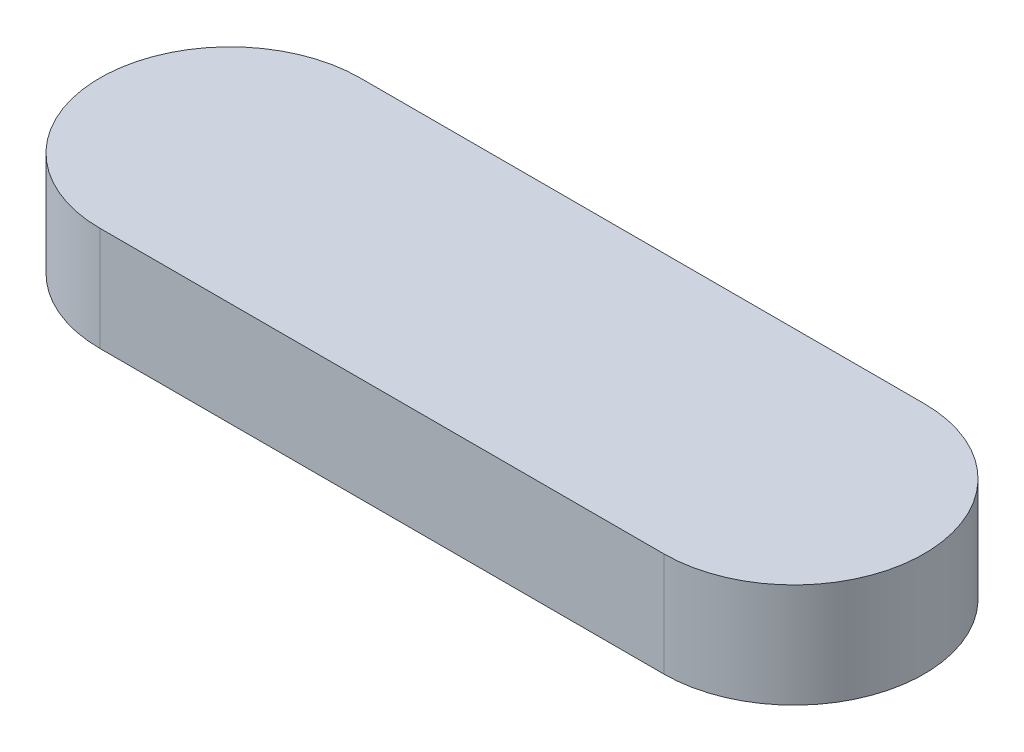
ISO-10303-21;
HEADER;
FILE_DESCRIPTION(('STEP AP214'),'2;1');
FILE_NAME('part.step','',(''),(''),'','','');
FILE_SCHEMA(('AUTOMOTIVE_DESIGN { 1 0 10303 214 1 1 1 1 }'));
ENDSEC;
DATA;
#1=APPLICATION_CONTEXT('core data for automotive mechanical design processes');
#2=APPLICATION_PROTOCOL_DEFINITION('international standard','automotive_design',2000,#1);
#3=PRODUCT_CONTEXT('',#1,'mechanical');
#4=PRODUCT('Part','Part','',(#3));
#5=PRODUCT_RELATED_PRODUCT_CATEGORY('part','',(#4));
#6=PRODUCT_DEFINITION_FORMATION('','',#4);
#7=PRODUCT_DEFINITION_CONTEXT('part definition',#1,'design');
#8=PRODUCT_DEFINITION('design','',#6,#7);
#9=PRODUCT_DEFINITION_SHAPE('','',#8);
#10=(LENGTH_UNIT() NAMED_UNIT(*) SI_UNIT(.MILLI.,.METRE.));
#11=(NAMED_UNIT(*) PLANE_ANGLE_UNIT() SI_UNIT($,.RADIAN.));
#12=(NAMED_UNIT(*) SI_UNIT($,.STERADIAN.) SOLID_ANGLE_UNIT());
#13=UNCERTAINTY_MEASURE_WITH_UNIT(LENGTH_MEASURE(1.E-05),#10,'distance_accuracy_value','');
#14=(GEOMETRIC_REPRESENTATION_CONTEXT(3) GLOBAL_UNCERTAINTY_ASSIGNED_CONTEXT((#13)) GLOBAL_UNIT_ASSIGNED_CONTEXT((#10,
#11,#12)) REPRESENTATION_CONTEXT('',''));
#15=CARTESIAN_POINT('',(0.,0.,0.));
#16=DIRECTION('',(0.,0.,1.));
#17=DIRECTION('',(1.,0.,0.));
#18=AXIS2_PLACEMENT_3D('',#15,#16,#17);
#19=CARTESIAN_POINT('',(-32.5,12.,-15.));
#20=DIRECTION('',(0.,0.,-1.));
#21=DIRECTION('',(-1.,0.,0.));
#22=AXIS2_PLACEMENT_3D('',#19,#20,#21);
#23=PLANE('',#22);
#24=DIRECTION('',(1.,0.,0.));
#25=VECTOR('',#24,1.);
#26=CARTESIAN_POINT('',(-32.5,0.,-15.));
#27=LINE('',#26,#25);
#28=CARTESIAN_POINT('',(-32.5,0.,-15.));
#29=VERTEX_POINT('',#28);
#30=CARTESIAN_POINT('',(32.5,0.,-15.));
#31=VERTEX_POINT('',#30);
#32=EDGE_CURVE('E106',#29,#31,#27,.T.);
#33=ORIENTED_EDGE('',*,*,#32,.F.);
#34=DIRECTION('',(0.,-1.,0.));
#35=VECTOR('',#34,1.);
#36=CARTESIAN_POINT('',(-32.5,12.,-15.));
#37=LINE('',#36,#35);
#38=CARTESIAN_POINT('',(-32.5,12.,-15.));
#39=VERTEX_POINT('',#38);
#40=EDGE_CURVE('E11',#39,#29,#37,.T.);
#41=ORIENTED_EDGE('',*,*,#40,.F.);
#42=DIRECTION('',(1.,0.,0.));
#43=VECTOR('',#42,1.);
#44=CARTESIAN_POINT('',(-32.5,12.,-15.));
#45=LINE('',#44,#43);
#46=CARTESIAN_POINT('',(32.5,12.,-15.));
#47=VERTEX_POINT('',#46);
#48=EDGE_CURVE('E101',#39,#47,#45,.T.);
#49=ORIENTED_EDGE('',*,*,#48,.T.);
#50=DIRECTION('',(0.,-1.,0.));
#51=VECTOR('',#50,1.);
#52=CARTESIAN_POINT('',(32.5,12.,-15.));
#53=LINE('',#52,#51);
#54=EDGE_CURVE('E44',#47,#31,#53,.T.);
#55=ORIENTED_EDGE('',*,*,#54,.T.);
#56=EDGE_LOOP('',(#33,#41,#49,#55));
#57=FACE_BOUND('',#56,.T.);
#58=ADVANCED_FACE('F41',(#57),#23,.T.);
#59=CARTESIAN_POINT('',(-32.5,12.,0.));
#60=DIRECTION('',(0.,-1.,0.));
#61=DIRECTION('',(0.,0.,-1.));
#62=AXIS2_PLACEMENT_3D('',#59,#60,#61);
#63=CYLINDRICAL_SURFACE('',#62,15.);
#64=CARTESIAN_POINT('',(-32.5,0.,0.));
#65=DIRECTION('',(0.,1.,0.));
#66=DIRECTION('',(0.,0.,1.));
#67=AXIS2_PLACEMENT_3D('',#64,#65,#66);
#68=CIRCLE('',#67,15.);
#69=CARTESIAN_POINT('',(-32.5,0.,15.));
#70=VERTEX_POINT('',#69);
#71=EDGE_CURVE('E74',#29,#70,#68,.T.);
#72=ORIENTED_EDGE('',*,*,#71,.T.);
#73=DIRECTION('',(0.,-1.,0.));
#74=VECTOR('',#73,1.);
#75=CARTESIAN_POINT('',(-32.5,12.,15.));
#76=LINE('',#75,#74);
#77=CARTESIAN_POINT('',(-32.5,12.,15.));
#78=VERTEX_POINT('',#77);
#79=EDGE_CURVE('E50',#78,#70,#76,.T.);
#80=ORIENTED_EDGE('',*,*,#79,.F.);
#81=CARTESIAN_POINT('',(-32.5,12.,0.));
#82=DIRECTION('',(0.,1.,0.));
#83=DIRECTION('',(0.,0.,1.));
#84=AXIS2_PLACEMENT_3D('',#81,#82,#83);
#85=CIRCLE('',#84,15.);
#86=EDGE_CURVE('E89',#39,#78,#85,.T.);
#87=ORIENTED_EDGE('',*,*,#86,.F.);
#88=ORIENTED_EDGE('',*,*,#40,.T.);
#89=EDGE_LOOP('',(#72,#80,#87,#88));
#90=FACE_BOUND('',#89,.T.);
#91=ADVANCED_FACE('F116',(#90),#63,.T.);
#92=CARTESIAN_POINT('',(-32.5,12.,15.));
#93=DIRECTION('',(0.,0.,-1.));
#94=DIRECTION('',(-1.,0.,0.));
#95=AXIS2_PLACEMENT_3D('',#92,#93,#94);
#96=PLANE('',#95);
#97=DIRECTION('',(1.,0.,0.));
#98=VECTOR('',#97,1.);
#99=CARTESIAN_POINT('',(-32.5,0.,15.));
#100=LINE('',#99,#98);
#101=CARTESIAN_POINT('',(32.5,0.,15.));
#102=VERTEX_POINT('',#101);
#103=EDGE_CURVE('E96',#70,#102,#100,.T.);
#104=ORIENTED_EDGE('',*,*,#103,.T.);
#105=DIRECTION('',(0.,-1.,0.));
#106=VECTOR('',#105,1.);
#107=CARTESIAN_POINT('',(32.5,12.,15.));
#108=LINE('',#107,#106);
#109=CARTESIAN_POINT('',(32.5,12.,15.));
#110=VERTEX_POINT('',#109);
#111=EDGE_CURVE('E93',#110,#102,#108,.T.);
#112=ORIENTED_EDGE('',*,*,#111,.F.);
#113=DIRECTION('',(1.,0.,0.));
#114=VECTOR('',#113,1.);
#115=CARTESIAN_POINT('',(-32.5,12.,15.));
#116=LINE('',#115,#114);
#117=EDGE_CURVE('E86',#78,#110,#116,.T.);
#118=ORIENTED_EDGE('',*,*,#117,.F.);
#119=ORIENTED_EDGE('',*,*,#79,.T.);
#120=EDGE_LOOP('',(#104,#112,#118,#119));
#121=FACE_BOUND('',#120,.T.);
#122=ADVANCED_FACE('F94',(#121),#96,.F.);
#123=CARTESIAN_POINT('',(32.5,12.,0.));
#124=DIRECTION('',(0.,-1.,0.));
#125=DIRECTION('',(0.,0.,-1.));
#126=AXIS2_PLACEMENT_3D('',#123,#124,#125);
#127=CYLINDRICAL_SURFACE('',#126,15.);
#128=CARTESIAN_POINT('',(32.5,0.,0.));
#129=DIRECTION('',(0.,1.,0.));
#130=DIRECTION('',(0.,0.,1.));
#131=AXIS2_PLACEMENT_3D('',#128,#129,#130);
#132=CIRCLE('',#131,15.);
#133=EDGE_CURVE('E109',#102,#31,#132,.T.);
#134=ORIENTED_EDGE('',*,*,#133,.T.);
#135=ORIENTED_EDGE('',*,*,#54,.F.);
#136=CARTESIAN_POINT('',(32.5,12.,0.));
#137=DIRECTION('',(0.,1.,0.));
#138=DIRECTION('',(0.,0.,1.));
#139=AXIS2_PLACEMENT_3D('',#136,#137,#138);
#140=CIRCLE('',#139,15.);
#141=EDGE_CURVE('E83',#110,#47,#140,.T.);
#142=ORIENTED_EDGE('',*,*,#141,.F.);
#143=ORIENTED_EDGE('',*,*,#111,.T.);
#144=EDGE_LOOP('',(#134,#135,#142,#143));
#145=FACE_BOUND('',#144,.T.);
#146=ADVANCED_FACE('F100',(#145),#127,.T.);
#147=CARTESIAN_POINT('',(32.5,12.,0.));
#148=DIRECTION('',(0.,1.,0.));
#149=DIRECTION('',(0.,0.,1.));
#150=AXIS2_PLACEMENT_3D('',#147,#148,#149);
#151=PLANE('',#150);
#152=ORIENTED_EDGE('',*,*,#48,.F.);
#153=ORIENTED_EDGE('',*,*,#86,.T.);
#154=ORIENTED_EDGE('',*,*,#117,.T.);
#155=ORIENTED_EDGE('',*,*,#141,.T.);
#156=EDGE_LOOP('',(#152,#153,#154,#155));
#157=FACE_BOUND('',#156,.T.);
#158=ADVANCED_FACE('F88',(#157),#151,.T.);
#159=CARTESIAN_POINT('',(32.5,0.,0.));
#160=DIRECTION('',(0.,1.,0.));
#161=DIRECTION('',(0.,0.,1.));
#162=AXIS2_PLACEMENT_3D('',#159,#160,#161);
#163=PLANE('',#162);
#164=ORIENTED_EDGE('',*,*,#32,.T.);
#165=ORIENTED_EDGE('',*,*,#133,.F.);
#166=ORIENTED_EDGE('',*,*,#103,.F.);
#167=ORIENTED_EDGE('',*,*,#71,.F.);
#168=EDGE_LOOP('',(#164,#165,#166,#167));
#169=FACE_BOUND('',#168,.T.);
#170=ADVANCED_FACE('F114',(#169),#163,.F.);
#171=CLOSED_SHELL('',(#58,#91,#122,#146,#158,#170));
#172=MANIFOLD_SOLID_BREP('B2',#171);
#173=ADVANCED_BREP_SHAPE_REPRESENTATION('',(#18,#172),#14);
#174=SHAPE_DEFINITION_REPRESENTATION(#9,#173);
ENDSEC;
END-ISO-10303-21;
